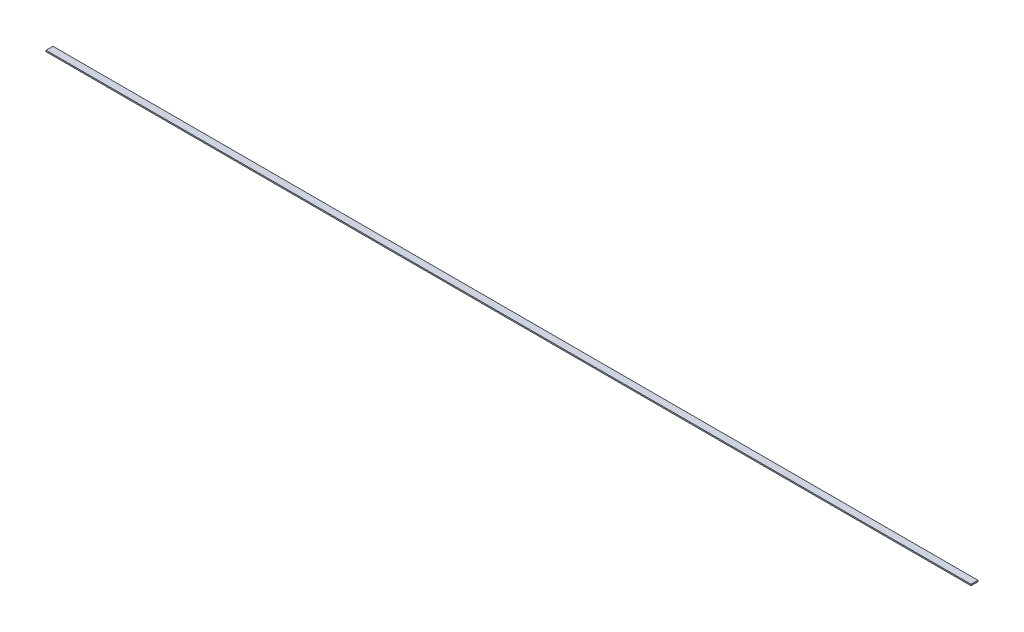
ISO-10303-21;
HEADER;
FILE_DESCRIPTION(('STEP AP214'),'2;1');
FILE_NAME('part.step','',(''),(''),'','','');
FILE_SCHEMA(('AUTOMOTIVE_DESIGN { 1 0 10303 214 1 1 1 1 }'));
ENDSEC;
DATA;
#1=APPLICATION_CONTEXT('core data for automotive mechanical design processes');
#2=APPLICATION_PROTOCOL_DEFINITION('international standard','automotive_design',2000,#1);
#3=PRODUCT_CONTEXT('',#1,'mechanical');
#4=PRODUCT('Part','Part','',(#3));
#5=PRODUCT_RELATED_PRODUCT_CATEGORY('part','',(#4));
#6=PRODUCT_DEFINITION_FORMATION('','',#4);
#7=PRODUCT_DEFINITION_CONTEXT('part definition',#1,'design');
#8=PRODUCT_DEFINITION('design','',#6,#7);
#9=PRODUCT_DEFINITION_SHAPE('','',#8);
#10=(LENGTH_UNIT() NAMED_UNIT(*) SI_UNIT(.MILLI.,.METRE.));
#11=(NAMED_UNIT(*) PLANE_ANGLE_UNIT() SI_UNIT($,.RADIAN.));
#12=(NAMED_UNIT(*) SI_UNIT($,.STERADIAN.) SOLID_ANGLE_UNIT());
#13=UNCERTAINTY_MEASURE_WITH_UNIT(LENGTH_MEASURE(1.E-05),#10,'distance_accuracy_value','');
#14=(GEOMETRIC_REPRESENTATION_CONTEXT(3) GLOBAL_UNCERTAINTY_ASSIGNED_CONTEXT((#13)) GLOBAL_UNIT_ASSIGNED_CONTEXT((#10,
#11,#12)) REPRESENTATION_CONTEXT('',''));
#15=CARTESIAN_POINT('',(0.,0.,0.));
#16=DIRECTION('',(0.,0.,1.));
#17=DIRECTION('',(1.,0.,0.));
#18=AXIS2_PLACEMENT_3D('',#15,#16,#17);
#19=CARTESIAN_POINT('',(0.,0.,0.));
#20=DIRECTION('',(0.,0.,-1.));
#21=DIRECTION('',(0.,-1.,0.));
#22=AXIS2_PLACEMENT_3D('',#19,#20,#21);
#23=PLANE('',#22);
#24=DIRECTION('',(0.,1.,0.));
#25=VECTOR('',#24,1.);
#26=CARTESIAN_POINT('',(400.,-0.545,0.));
#27=LINE('',#26,#25);
#28=CARTESIAN_POINT('',(400.,-0.545,0.));
#29=VERTEX_POINT('',#28);
#30=CARTESIAN_POINT('',(400.,0.545,0.));
#31=VERTEX_POINT('',#30);
#32=EDGE_CURVE('E80',#29,#31,#27,.T.);
#33=ORIENTED_EDGE('',*,*,#32,.F.);
#34=DIRECTION('',(1.,0.,0.));
#35=VECTOR('',#34,1.);
#36=CARTESIAN_POINT('',(-400.,-0.545,0.));
#37=LINE('',#36,#35);
#38=CARTESIAN_POINT('',(-400.,-0.545,0.));
#39=VERTEX_POINT('',#38);
#40=EDGE_CURVE('E21',#39,#29,#37,.T.);
#41=ORIENTED_EDGE('',*,*,#40,.F.);
#42=DIRECTION('',(0.,-1.,0.));
#43=VECTOR('',#42,1.);
#44=CARTESIAN_POINT('',(-400.,-0.545,0.));
#45=LINE('',#44,#43);
#46=CARTESIAN_POINT('',(-400.,0.545,0.));
#47=VERTEX_POINT('',#46);
#48=EDGE_CURVE('E103',#47,#39,#45,.T.);
#49=ORIENTED_EDGE('',*,*,#48,.F.);
#50=DIRECTION('',(-1.,0.,0.));
#51=VECTOR('',#50,1.);
#52=CARTESIAN_POINT('',(-400.,0.545,0.));
#53=LINE('',#52,#51);
#54=EDGE_CURVE('E84',#31,#47,#53,.T.);
#55=ORIENTED_EDGE('',*,*,#54,.F.);
#56=EDGE_LOOP('',(#33,#41,#49,#55));
#57=FACE_BOUND('',#56,.T.);
#58=ADVANCED_FACE('F18',(#57),#23,.T.);
#59=CARTESIAN_POINT('',(0.,0.,6.));
#60=DIRECTION('',(0.,0.,-1.));
#61=DIRECTION('',(0.,-1.,0.));
#62=AXIS2_PLACEMENT_3D('',#59,#60,#61);
#63=PLANE('',#62);
#64=DIRECTION('',(0.,1.,0.));
#65=VECTOR('',#64,1.);
#66=CARTESIAN_POINT('',(400.,-0.545,6.));
#67=LINE('',#66,#65);
#68=CARTESIAN_POINT('',(400.,-0.545,6.));
#69=VERTEX_POINT('',#68);
#70=CARTESIAN_POINT('',(400.,0.545,6.));
#71=VERTEX_POINT('',#70);
#72=EDGE_CURVE('E82',#69,#71,#67,.T.);
#73=ORIENTED_EDGE('',*,*,#72,.T.);
#74=DIRECTION('',(-1.,0.,0.));
#75=VECTOR('',#74,1.);
#76=CARTESIAN_POINT('',(-400.,0.545,6.));
#77=LINE('',#76,#75);
#78=CARTESIAN_POINT('',(-400.,0.545,6.));
#79=VERTEX_POINT('',#78);
#80=EDGE_CURVE('E99',#71,#79,#77,.T.);
#81=ORIENTED_EDGE('',*,*,#80,.T.);
#82=DIRECTION('',(0.,-1.,0.));
#83=VECTOR('',#82,1.);
#84=CARTESIAN_POINT('',(-400.,-0.545,6.));
#85=LINE('',#84,#83);
#86=CARTESIAN_POINT('',(-400.,-0.545,6.));
#87=VERTEX_POINT('',#86);
#88=EDGE_CURVE('E75',#79,#87,#85,.T.);
#89=ORIENTED_EDGE('',*,*,#88,.T.);
#90=DIRECTION('',(1.,0.,0.));
#91=VECTOR('',#90,1.);
#92=CARTESIAN_POINT('',(-400.,-0.545,6.));
#93=LINE('',#92,#91);
#94=EDGE_CURVE('E11',#87,#69,#93,.T.);
#95=ORIENTED_EDGE('',*,*,#94,.T.);
#96=EDGE_LOOP('',(#73,#81,#89,#95));
#97=FACE_BOUND('',#96,.T.);
#98=ADVANCED_FACE('F123',(#97),#63,.F.);
#99=CARTESIAN_POINT('',(-400.,-0.545,6.));
#100=DIRECTION('',(0.,1.,0.));
#101=DIRECTION('',(1.,0.,0.));
#102=AXIS2_PLACEMENT_3D('',#99,#100,#101);
#103=PLANE('',#102);
#104=ORIENTED_EDGE('',*,*,#40,.T.);
#105=DIRECTION('',(0.,0.,-1.));
#106=VECTOR('',#105,1.);
#107=CARTESIAN_POINT('',(400.,-0.545,6.));
#108=LINE('',#107,#106);
#109=EDGE_CURVE('E67',#69,#29,#108,.T.);
#110=ORIENTED_EDGE('',*,*,#109,.F.);
#111=ORIENTED_EDGE('',*,*,#94,.F.);
#112=DIRECTION('',(0.,0.,-1.));
#113=VECTOR('',#112,1.);
#114=CARTESIAN_POINT('',(-400.,-0.545,6.));
#115=LINE('',#114,#113);
#116=EDGE_CURVE('E70',#87,#39,#115,.T.);
#117=ORIENTED_EDGE('',*,*,#116,.T.);
#118=EDGE_LOOP('',(#104,#110,#111,#117));
#119=FACE_BOUND('',#118,.T.);
#120=ADVANCED_FACE('F66',(#119),#103,.F.);
#121=CARTESIAN_POINT('',(-400.,-0.545,6.));
#122=DIRECTION('',(1.,0.,0.));
#123=DIRECTION('',(0.,1.,0.));
#124=AXIS2_PLACEMENT_3D('',#121,#122,#123);
#125=PLANE('',#124);
#126=ORIENTED_EDGE('',*,*,#48,.T.);
#127=ORIENTED_EDGE('',*,*,#116,.F.);
#128=ORIENTED_EDGE('',*,*,#88,.F.);
#129=DIRECTION('',(0.,0.,-1.));
#130=VECTOR('',#129,1.);
#131=CARTESIAN_POINT('',(-400.,0.545,6.));
#132=LINE('',#131,#130);
#133=EDGE_CURVE('E104',#79,#47,#132,.T.);
#134=ORIENTED_EDGE('',*,*,#133,.T.);
#135=EDGE_LOOP('',(#126,#127,#128,#134));
#136=FACE_BOUND('',#135,.T.);
#137=ADVANCED_FACE('F117',(#136),#125,.F.);
#138=CARTESIAN_POINT('',(-400.,0.545,6.));
#139=DIRECTION('',(0.,-1.,0.));
#140=DIRECTION('',(0.,0.,-1.));
#141=AXIS2_PLACEMENT_3D('',#138,#139,#140);
#142=PLANE('',#141);
#143=ORIENTED_EDGE('',*,*,#54,.T.);
#144=ORIENTED_EDGE('',*,*,#133,.F.);
#145=ORIENTED_EDGE('',*,*,#80,.F.);
#146=DIRECTION('',(0.,0.,-1.));
#147=VECTOR('',#146,1.);
#148=CARTESIAN_POINT('',(400.,0.545,6.));
#149=LINE('',#148,#147);
#150=EDGE_CURVE('E89',#71,#31,#149,.T.);
#151=ORIENTED_EDGE('',*,*,#150,.T.);
#152=EDGE_LOOP('',(#143,#144,#145,#151));
#153=FACE_BOUND('',#152,.T.);
#154=ADVANCED_FACE('F121',(#153),#142,.F.);
#155=CARTESIAN_POINT('',(400.,-0.545,6.));
#156=DIRECTION('',(-1.,0.,0.));
#157=DIRECTION('',(0.,0.,1.));
#158=AXIS2_PLACEMENT_3D('',#155,#156,#157);
#159=PLANE('',#158);
#160=ORIENTED_EDGE('',*,*,#32,.T.);
#161=ORIENTED_EDGE('',*,*,#150,.F.);
#162=ORIENTED_EDGE('',*,*,#72,.F.);
#163=ORIENTED_EDGE('',*,*,#109,.T.);
#164=EDGE_LOOP('',(#160,#161,#162,#163));
#165=FACE_BOUND('',#164,.T.);
#166=ADVANCED_FACE('F78',(#165),#159,.F.);
#167=CLOSED_SHELL('',(#58,#98,#120,#137,#154,#166));
#168=MANIFOLD_SOLID_BREP('B1',#167);
#169=ADVANCED_BREP_SHAPE_REPRESENTATION('',(#18,#168),#14);
#170=SHAPE_DEFINITION_REPRESENTATION(#9,#169);
ENDSEC;
END-ISO-10303-21;
